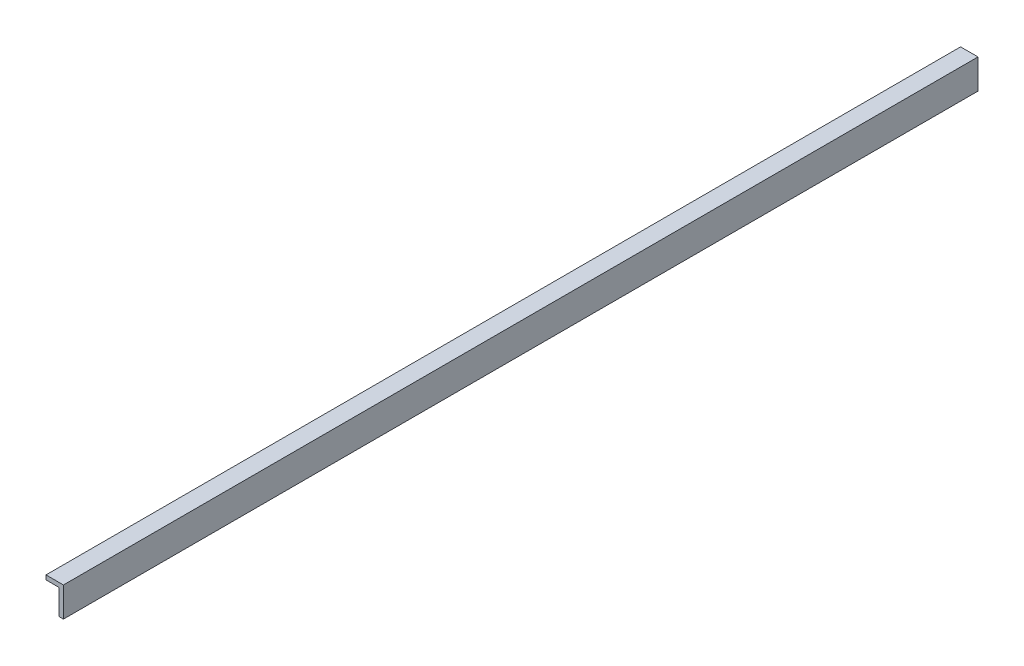
ISO-10303-21;
HEADER;
FILE_DESCRIPTION(('STEP AP214'),'2;1');
FILE_NAME('part.step','',(''),(''),'','','');
FILE_SCHEMA(('AUTOMOTIVE_DESIGN { 1 0 10303 214 1 1 1 1 }'));
ENDSEC;
DATA;
#1=APPLICATION_CONTEXT('core data for automotive mechanical design processes');
#2=APPLICATION_PROTOCOL_DEFINITION('international standard','automotive_design',2000,#1);
#3=PRODUCT_CONTEXT('',#1,'mechanical');
#4=PRODUCT('Part','Part','',(#3));
#5=PRODUCT_RELATED_PRODUCT_CATEGORY('part','',(#4));
#6=PRODUCT_DEFINITION_FORMATION('','',#4);
#7=PRODUCT_DEFINITION_CONTEXT('part definition',#1,'design');
#8=PRODUCT_DEFINITION('design','',#6,#7);
#9=PRODUCT_DEFINITION_SHAPE('','',#8);
#10=(LENGTH_UNIT() NAMED_UNIT(*) SI_UNIT(.MILLI.,.METRE.));
#11=(NAMED_UNIT(*) PLANE_ANGLE_UNIT() SI_UNIT($,.RADIAN.));
#12=(NAMED_UNIT(*) SI_UNIT($,.STERADIAN.) SOLID_ANGLE_UNIT());
#13=UNCERTAINTY_MEASURE_WITH_UNIT(LENGTH_MEASURE(1.E-05),#10,'distance_accuracy_value','');
#14=(GEOMETRIC_REPRESENTATION_CONTEXT(3) GLOBAL_UNCERTAINTY_ASSIGNED_CONTEXT((#13)) GLOBAL_UNIT_ASSIGNED_CONTEXT((#10,
#11,#12)) REPRESENTATION_CONTEXT('',''));
#15=CARTESIAN_POINT('',(0.,0.,0.));
#16=DIRECTION('',(0.,0.,1.));
#17=DIRECTION('',(1.,0.,0.));
#18=AXIS2_PLACEMENT_3D('',#15,#16,#17);
#19=CARTESIAN_POINT('',(0.,0.,-1050.));
#20=DIRECTION('',(0.,0.,-1.));
#21=DIRECTION('',(-1.,0.,0.));
#22=AXIS2_PLACEMENT_3D('',#19,#20,#21);
#23=PLANE('',#22);
#24=DIRECTION('',(-1.,0.,0.));
#25=VECTOR('',#24,1.);
#26=CARTESIAN_POINT('',(-5.,34.,-1050.));
#27=LINE('',#26,#25);
#28=CARTESIAN_POINT('',(0.,34.,-1050.));
#29=VERTEX_POINT('',#28);
#30=CARTESIAN_POINT('',(-20.,34.,-1050.));
#31=VERTEX_POINT('',#30);
#32=EDGE_CURVE('E161',#29,#31,#27,.T.);
#33=ORIENTED_EDGE('',*,*,#32,.F.);
#34=DIRECTION('',(0.,1.,0.));
#35=VECTOR('',#34,1.);
#36=CARTESIAN_POINT('',(0.,0.,-1050.));
#37=LINE('',#36,#35);
#38=CARTESIAN_POINT('',(0.,0.,-1050.));
#39=VERTEX_POINT('',#38);
#40=EDGE_CURVE('E132',#39,#29,#37,.T.);
#41=ORIENTED_EDGE('',*,*,#40,.F.);
#42=DIRECTION('',(-1.,0.,0.));
#43=VECTOR('',#42,1.);
#44=CARTESIAN_POINT('',(0.,0.,-1050.));
#45=LINE('',#44,#43);
#46=CARTESIAN_POINT('',(-5.,0.,-1050.));
#47=VERTEX_POINT('',#46);
#48=EDGE_CURVE('E142',#39,#47,#45,.T.);
#49=ORIENTED_EDGE('',*,*,#48,.T.);
#50=DIRECTION('',(0.,1.,0.));
#51=VECTOR('',#50,1.);
#52=CARTESIAN_POINT('',(-5.,0.,-1050.));
#53=LINE('',#52,#51);
#54=CARTESIAN_POINT('',(-5.,29.,-1050.));
#55=VERTEX_POINT('',#54);
#56=EDGE_CURVE('E139',#47,#55,#53,.T.);
#57=ORIENTED_EDGE('',*,*,#56,.T.);
#58=DIRECTION('',(-1.,0.,0.));
#59=VECTOR('',#58,1.);
#60=CARTESIAN_POINT('',(-5.,29.,-1050.));
#61=LINE('',#60,#59);
#62=CARTESIAN_POINT('',(-20.,29.,-1050.));
#63=VERTEX_POINT('',#62);
#64=EDGE_CURVE('E124',#55,#63,#61,.T.);
#65=ORIENTED_EDGE('',*,*,#64,.T.);
#66=DIRECTION('',(0.,-1.,0.));
#67=VECTOR('',#66,1.);
#68=CARTESIAN_POINT('',(-20.,34.,-1050.));
#69=LINE('',#68,#67);
#70=EDGE_CURVE('E166',#31,#63,#69,.T.);
#71=ORIENTED_EDGE('',*,*,#70,.F.);
#72=EDGE_LOOP('',(#33,#41,#49,#57,#65,#71));
#73=FACE_BOUND('',#72,.T.);
#74=ADVANCED_FACE('F61',(#73),#23,.T.);
#75=CARTESIAN_POINT('',(-20.,34.,-1050.));
#76=DIRECTION('',(-1.,0.,0.));
#77=DIRECTION('',(0.,0.,1.));
#78=AXIS2_PLACEMENT_3D('',#75,#76,#77);
#79=PLANE('',#78);
#80=DIRECTION('',(0.,-1.,0.));
#81=VECTOR('',#80,1.);
#82=CARTESIAN_POINT('',(-20.,34.,0.));
#83=LINE('',#82,#81);
#84=CARTESIAN_POINT('',(-20.,34.,0.));
#85=VERTEX_POINT('',#84);
#86=CARTESIAN_POINT('',(-20.,29.,0.));
#87=VERTEX_POINT('',#86);
#88=EDGE_CURVE('E125',#85,#87,#83,.T.);
#89=ORIENTED_EDGE('',*,*,#88,.F.);
#90=DIRECTION('',(0.,0.,1.));
#91=VECTOR('',#90,1.);
#92=CARTESIAN_POINT('',(-20.,34.,-1050.));
#93=LINE('',#92,#91);
#94=EDGE_CURVE('E80',#31,#85,#93,.T.);
#95=ORIENTED_EDGE('',*,*,#94,.F.);
#96=ORIENTED_EDGE('',*,*,#70,.T.);
#97=DIRECTION('',(0.,0.,1.));
#98=VECTOR('',#97,1.);
#99=CARTESIAN_POINT('',(-20.,29.,-1050.));
#100=LINE('',#99,#98);
#101=EDGE_CURVE('E71',#63,#87,#100,.T.);
#102=ORIENTED_EDGE('',*,*,#101,.T.);
#103=EDGE_LOOP('',(#89,#95,#96,#102));
#104=FACE_BOUND('',#103,.T.);
#105=ADVANCED_FACE('F165',(#104),#79,.T.);
#106=CARTESIAN_POINT('',(0.,0.,0.));
#107=DIRECTION('',(0.,0.,-1.));
#108=DIRECTION('',(-1.,0.,0.));
#109=AXIS2_PLACEMENT_3D('',#106,#107,#108);
#110=PLANE('',#109);
#111=DIRECTION('',(-1.,0.,0.));
#112=VECTOR('',#111,1.);
#113=CARTESIAN_POINT('',(-5.,29.,0.));
#114=LINE('',#113,#112);
#115=CARTESIAN_POINT('',(-5.,29.,0.));
#116=VERTEX_POINT('',#115);
#117=EDGE_CURVE('E133',#116,#87,#114,.T.);
#118=ORIENTED_EDGE('',*,*,#117,.F.);
#119=DIRECTION('',(0.,1.,0.));
#120=VECTOR('',#119,1.);
#121=CARTESIAN_POINT('',(-5.,0.,0.));
#122=LINE('',#121,#120);
#123=CARTESIAN_POINT('',(-5.,0.,0.));
#124=VERTEX_POINT('',#123);
#125=EDGE_CURVE('E144',#124,#116,#122,.T.);
#126=ORIENTED_EDGE('',*,*,#125,.F.);
#127=DIRECTION('',(-1.,0.,0.));
#128=VECTOR('',#127,1.);
#129=CARTESIAN_POINT('',(0.,0.,0.));
#130=LINE('',#129,#128);
#131=CARTESIAN_POINT('',(0.,0.,0.));
#132=VERTEX_POINT('',#131);
#133=EDGE_CURVE('E138',#132,#124,#130,.T.);
#134=ORIENTED_EDGE('',*,*,#133,.F.);
#135=DIRECTION('',(0.,1.,0.));
#136=VECTOR('',#135,1.);
#137=CARTESIAN_POINT('',(0.,0.,0.));
#138=LINE('',#137,#136);
#139=CARTESIAN_POINT('',(0.,34.,0.));
#140=VERTEX_POINT('',#139);
#141=EDGE_CURVE('E130',#132,#140,#138,.T.);
#142=ORIENTED_EDGE('',*,*,#141,.T.);
#143=DIRECTION('',(-1.,0.,0.));
#144=VECTOR('',#143,1.);
#145=CARTESIAN_POINT('',(-5.,34.,0.));
#146=LINE('',#145,#144);
#147=EDGE_CURVE('E115',#140,#85,#146,.T.);
#148=ORIENTED_EDGE('',*,*,#147,.T.);
#149=ORIENTED_EDGE('',*,*,#88,.T.);
#150=EDGE_LOOP('',(#118,#126,#134,#142,#148,#149));
#151=FACE_BOUND('',#150,.T.);
#152=ADVANCED_FACE('F136',(#151),#110,.F.);
#153=CARTESIAN_POINT('',(-5.,29.,-1050.));
#154=DIRECTION('',(0.,1.,0.));
#155=DIRECTION('',(0.,0.,1.));
#156=AXIS2_PLACEMENT_3D('',#153,#154,#155);
#157=PLANE('',#156);
#158=ORIENTED_EDGE('',*,*,#117,.T.);
#159=ORIENTED_EDGE('',*,*,#101,.F.);
#160=ORIENTED_EDGE('',*,*,#64,.F.);
#161=DIRECTION('',(0.,0.,1.));
#162=VECTOR('',#161,1.);
#163=CARTESIAN_POINT('',(-5.,29.,-1050.));
#164=LINE('',#163,#162);
#165=EDGE_CURVE('E12',#55,#116,#164,.T.);
#166=ORIENTED_EDGE('',*,*,#165,.T.);
#167=EDGE_LOOP('',(#158,#159,#160,#166));
#168=FACE_BOUND('',#167,.T.);
#169=ADVANCED_FACE('F168',(#168),#157,.F.);
#170=CARTESIAN_POINT('',(-5.,34.,-1050.));
#171=DIRECTION('',(0.,1.,0.));
#172=DIRECTION('',(-1.,0.,0.));
#173=AXIS2_PLACEMENT_3D('',#170,#171,#172);
#174=PLANE('',#173);
#175=ORIENTED_EDGE('',*,*,#147,.F.);
#176=DIRECTION('',(0.,0.,1.));
#177=VECTOR('',#176,1.);
#178=CARTESIAN_POINT('',(0.,34.,-1050.));
#179=LINE('',#178,#177);
#180=EDGE_CURVE('E119',#29,#140,#179,.T.);
#181=ORIENTED_EDGE('',*,*,#180,.F.);
#182=ORIENTED_EDGE('',*,*,#32,.T.);
#183=ORIENTED_EDGE('',*,*,#94,.T.);
#184=EDGE_LOOP('',(#175,#181,#182,#183));
#185=FACE_BOUND('',#184,.T.);
#186=ADVANCED_FACE('F117',(#185),#174,.T.);
#187=CARTESIAN_POINT('',(0.,0.,-1050.));
#188=DIRECTION('',(1.,0.,0.));
#189=DIRECTION('',(0.,0.,-1.));
#190=AXIS2_PLACEMENT_3D('',#187,#188,#189);
#191=PLANE('',#190);
#192=ORIENTED_EDGE('',*,*,#141,.F.);
#193=DIRECTION('',(0.,0.,1.));
#194=VECTOR('',#193,1.);
#195=CARTESIAN_POINT('',(0.,0.,-1050.));
#196=LINE('',#195,#194);
#197=EDGE_CURVE('E109',#39,#132,#196,.T.);
#198=ORIENTED_EDGE('',*,*,#197,.F.);
#199=ORIENTED_EDGE('',*,*,#40,.T.);
#200=ORIENTED_EDGE('',*,*,#180,.T.);
#201=EDGE_LOOP('',(#192,#198,#199,#200));
#202=FACE_BOUND('',#201,.T.);
#203=ADVANCED_FACE('F129',(#202),#191,.T.);
#204=CARTESIAN_POINT('',(0.,0.,-1050.));
#205=DIRECTION('',(0.,1.,0.));
#206=DIRECTION('',(-1.,0.,0.));
#207=AXIS2_PLACEMENT_3D('',#204,#205,#206);
#208=PLANE('',#207);
#209=ORIENTED_EDGE('',*,*,#133,.T.);
#210=DIRECTION('',(0.,0.,1.));
#211=VECTOR('',#210,1.);
#212=CARTESIAN_POINT('',(-5.,0.,-1050.));
#213=LINE('',#212,#211);
#214=EDGE_CURVE('E65',#47,#124,#213,.T.);
#215=ORIENTED_EDGE('',*,*,#214,.F.);
#216=ORIENTED_EDGE('',*,*,#48,.F.);
#217=ORIENTED_EDGE('',*,*,#197,.T.);
#218=EDGE_LOOP('',(#209,#215,#216,#217));
#219=FACE_BOUND('',#218,.T.);
#220=ADVANCED_FACE('F171',(#219),#208,.F.);
#221=CARTESIAN_POINT('',(-5.,0.,-1050.));
#222=DIRECTION('',(1.,0.,0.));
#223=DIRECTION('',(0.,1.,0.));
#224=AXIS2_PLACEMENT_3D('',#221,#222,#223);
#225=PLANE('',#224);
#226=ORIENTED_EDGE('',*,*,#165,.F.);
#227=ORIENTED_EDGE('',*,*,#56,.F.);
#228=ORIENTED_EDGE('',*,*,#214,.T.);
#229=ORIENTED_EDGE('',*,*,#125,.T.);
#230=EDGE_LOOP('',(#226,#227,#228,#229));
#231=FACE_BOUND('',#230,.T.);
#232=ADVANCED_FACE('F63',(#231),#225,.F.);
#233=CLOSED_SHELL('',(#74,#105,#152,#169,#186,#203,#220,#232));
#234=MANIFOLD_SOLID_BREP('B2',#233);
#235=ADVANCED_BREP_SHAPE_REPRESENTATION('',(#18,#234),#14);
#236=SHAPE_DEFINITION_REPRESENTATION(#9,#235);
ENDSEC;
END-ISO-10303-21;
